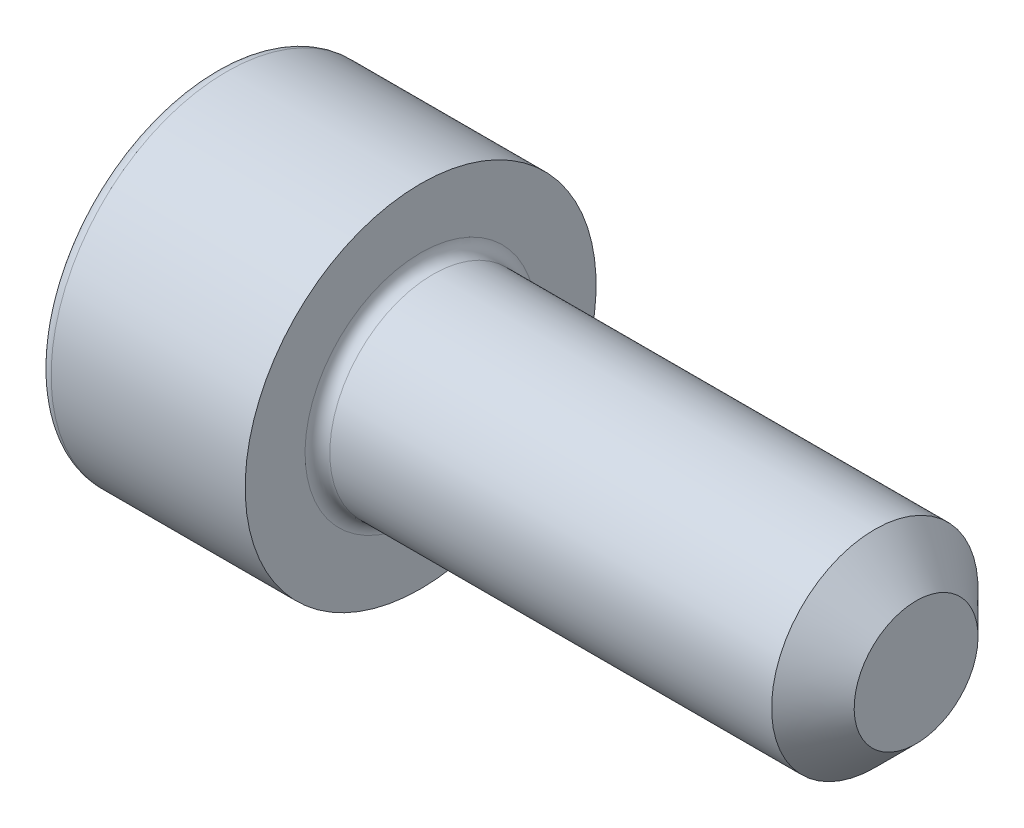
ISO-10303-21;
HEADER;
FILE_DESCRIPTION(('STEP AP214'),'2;1');
FILE_NAME('part.step','',(''),(''),'','','');
FILE_SCHEMA(('AUTOMOTIVE_DESIGN { 1 0 10303 214 1 1 1 1 }'));
ENDSEC;
DATA;
#1=APPLICATION_CONTEXT('core data for automotive mechanical design processes');
#2=APPLICATION_PROTOCOL_DEFINITION('international standard','automotive_design',2000,#1);
#3=PRODUCT_CONTEXT('',#1,'mechanical');
#4=PRODUCT('Part','Part','',(#3));
#5=PRODUCT_RELATED_PRODUCT_CATEGORY('part','',(#4));
#6=PRODUCT_DEFINITION_FORMATION('','',#4);
#7=PRODUCT_DEFINITION_CONTEXT('part definition',#1,'design');
#8=PRODUCT_DEFINITION('design','',#6,#7);
#9=PRODUCT_DEFINITION_SHAPE('','',#8);
#10=(LENGTH_UNIT() NAMED_UNIT(*) SI_UNIT(.MILLI.,.METRE.));
#11=(NAMED_UNIT(*) PLANE_ANGLE_UNIT() SI_UNIT($,.RADIAN.));
#12=(NAMED_UNIT(*) SI_UNIT($,.STERADIAN.) SOLID_ANGLE_UNIT());
#13=UNCERTAINTY_MEASURE_WITH_UNIT(LENGTH_MEASURE(1.E-05),#10,'distance_accuracy_value','');
#14=(GEOMETRIC_REPRESENTATION_CONTEXT(3) GLOBAL_UNCERTAINTY_ASSIGNED_CONTEXT((#13)) GLOBAL_UNIT_ASSIGNED_CONTEXT((#10,
#11,#12)) REPRESENTATION_CONTEXT('',''));
#15=CARTESIAN_POINT('',(0.,0.,0.));
#16=DIRECTION('',(0.,0.,1.));
#17=DIRECTION('',(1.,0.,0.));
#18=AXIS2_PLACEMENT_3D('',#15,#16,#17);
#19=CARTESIAN_POINT('',(0.,0.,0.));
#20=DIRECTION('',(-1.,0.,0.));
#21=DIRECTION('',(0.,-1.,0.));
#22=AXIS2_PLACEMENT_3D('',#19,#20,#21);
#23=PLANE('',#22);
#24=CARTESIAN_POINT('',(0.,0.,0.));
#25=DIRECTION('',(-1.,0.,0.));
#26=DIRECTION('',(0.,-1.,0.));
#27=AXIS2_PLACEMENT_3D('',#24,#25,#26);
#28=CIRCLE('',#27,3.95);
#29=CARTESIAN_POINT('',(0.,-3.95,0.));
#30=VERTEX_POINT('',#29);
#31=EDGE_CURVE('E158',#30,#30,#28,.T.);
#32=ORIENTED_EDGE('',*,*,#31,.T.);
#33=EDGE_LOOP('',(#32));
#34=FACE_BOUND('',#33,.T.);
#35=DIRECTION('',(0.,0.,-1.));
#36=VECTOR('',#35,1.);
#37=CARTESIAN_POINT('',(0.,2.,1.15470053837925));
#38=LINE('',#37,#36);
#39=CARTESIAN_POINT('',(0.,2.,1.15470053837925));
#40=VERTEX_POINT('',#39);
#41=CARTESIAN_POINT('',(0.,2.,-1.15470053837925));
#42=VERTEX_POINT('',#41);
#43=EDGE_CURVE('E54',#40,#42,#38,.T.);
#44=ORIENTED_EDGE('',*,*,#43,.F.);
#45=DIRECTION('',(0.,0.866025403784439,-0.5));
#46=VECTOR('',#45,1.);
#47=CARTESIAN_POINT('',(0.,0.,2.3094010767585));
#48=LINE('',#47,#46);
#49=CARTESIAN_POINT('',(0.,0.,2.3094010767585));
#50=VERTEX_POINT('',#49);
#51=EDGE_CURVE('E137',#50,#40,#48,.T.);
#52=ORIENTED_EDGE('',*,*,#51,.F.);
#53=DIRECTION('',(0.,0.866025403784438,0.5));
#54=VECTOR('',#53,1.);
#55=CARTESIAN_POINT('',(0.,-2.,1.15470053837925));
#56=LINE('',#55,#54);
#57=CARTESIAN_POINT('',(0.,-2.,1.15470053837925));
#58=VERTEX_POINT('',#57);
#59=EDGE_CURVE('E135',#58,#50,#56,.T.);
#60=ORIENTED_EDGE('',*,*,#59,.F.);
#61=DIRECTION('',(0.,0.,1.));
#62=VECTOR('',#61,1.);
#63=CARTESIAN_POINT('',(0.,-2.,-1.15470053837925));
#64=LINE('',#63,#62);
#65=CARTESIAN_POINT('',(0.,-2.,-1.15470053837925));
#66=VERTEX_POINT('',#65);
#67=EDGE_CURVE('E102',#66,#58,#64,.T.);
#68=ORIENTED_EDGE('',*,*,#67,.F.);
#69=DIRECTION('',(0.,-0.866025403784439,0.5));
#70=VECTOR('',#69,1.);
#71=CARTESIAN_POINT('',(0.,0.,-2.3094010767585));
#72=LINE('',#71,#70);
#73=CARTESIAN_POINT('',(0.,0.,-2.3094010767585));
#74=VERTEX_POINT('',#73);
#75=EDGE_CURVE('E131',#74,#66,#72,.T.);
#76=ORIENTED_EDGE('',*,*,#75,.F.);
#77=DIRECTION('',(0.,-0.866025403784439,-0.5));
#78=VECTOR('',#77,1.);
#79=CARTESIAN_POINT('',(0.,2.,-1.15470053837925));
#80=LINE('',#79,#78);
#81=EDGE_CURVE('E128',#42,#74,#80,.T.);
#82=ORIENTED_EDGE('',*,*,#81,.F.);
#83=EDGE_LOOP('',(#44,#52,#60,#68,#76,#82));
#84=FACE_BOUND('',#83,.T.);
#85=ADVANCED_FACE('F38',(#34,#84),#23,.T.);
#86=CARTESIAN_POINT('',(17.,0.,0.));
#87=DIRECTION('',(1.,0.,0.));
#88=DIRECTION('',(0.,1.,0.));
#89=AXIS2_PLACEMENT_3D('',#86,#87,#88);
#90=CYLINDRICAL_SURFACE('',#89,4.25);
#91=CARTESIAN_POINT('',(0.300000000000002,0.,0.));
#92=DIRECTION('',(-1.,0.,0.));
#93=DIRECTION('',(0.,-1.,0.));
#94=AXIS2_PLACEMENT_3D('',#91,#92,#93);
#95=CIRCLE('',#94,4.25);
#96=CARTESIAN_POINT('',(0.300000000000002,-4.25,0.));
#97=VERTEX_POINT('',#96);
#98=EDGE_CURVE('E155',#97,#97,#95,.F.);
#99=ORIENTED_EDGE('',*,*,#98,.T.);
#100=EDGE_LOOP('',(#99));
#101=FACE_BOUND('',#100,.T.);
#102=CARTESIAN_POINT('',(5.,0.,0.));
#103=DIRECTION('',(1.,0.,0.));
#104=DIRECTION('',(0.,1.,0.));
#105=AXIS2_PLACEMENT_3D('',#102,#103,#104);
#106=CIRCLE('',#105,4.25);
#107=CARTESIAN_POINT('',(5.,4.25,0.));
#108=VERTEX_POINT('',#107);
#109=EDGE_CURVE('E141',#108,#108,#106,.T.);
#110=ORIENTED_EDGE('',*,*,#109,.F.);
#111=EDGE_LOOP('',(#110));
#112=FACE_BOUND('',#111,.T.);
#113=ADVANCED_FACE('F175',(#101,#112),#90,.T.);
#114=CARTESIAN_POINT('',(5.,4.25,0.));
#115=DIRECTION('',(1.,0.,0.));
#116=DIRECTION('',(0.,1.,0.));
#117=AXIS2_PLACEMENT_3D('',#114,#115,#116);
#118=PLANE('',#117);
#119=CARTESIAN_POINT('',(5.,0.,0.));
#120=DIRECTION('',(1.,0.,0.));
#121=DIRECTION('',(0.,1.,0.));
#122=AXIS2_PLACEMENT_3D('',#119,#120,#121);
#123=CIRCLE('',#122,2.8);
#124=CARTESIAN_POINT('',(5.,2.8,0.));
#125=VERTEX_POINT('',#124);
#126=EDGE_CURVE('E152',#125,#125,#123,.F.);
#127=ORIENTED_EDGE('',*,*,#126,.T.);
#128=EDGE_LOOP('',(#127));
#129=FACE_BOUND('',#128,.T.);
#130=ORIENTED_EDGE('',*,*,#109,.T.);
#131=EDGE_LOOP('',(#130));
#132=FACE_BOUND('',#131,.T.);
#133=ADVANCED_FACE('F181',(#129,#132),#118,.T.);
#134=CARTESIAN_POINT('',(17.,0.,0.));
#135=DIRECTION('',(1.,0.,0.));
#136=DIRECTION('',(0.,1.,0.));
#137=AXIS2_PLACEMENT_3D('',#134,#135,#136);
#138=CYLINDRICAL_SURFACE('',#137,2.5);
#139=CARTESIAN_POINT('',(16.,0.,0.));
#140=DIRECTION('',(1.,0.,0.));
#141=DIRECTION('',(0.,1.,0.));
#142=AXIS2_PLACEMENT_3D('',#139,#140,#141);
#143=CIRCLE('',#142,2.5);
#144=CARTESIAN_POINT('',(16.,2.5,0.));
#145=VERTEX_POINT('',#144);
#146=EDGE_CURVE('E11',#145,#145,#143,.F.);
#147=ORIENTED_EDGE('',*,*,#146,.T.);
#148=EDGE_LOOP('',(#147));
#149=FACE_BOUND('',#148,.T.);
#150=CARTESIAN_POINT('',(5.3,0.,0.));
#151=DIRECTION('',(1.,0.,0.));
#152=DIRECTION('',(0.,1.,0.));
#153=AXIS2_PLACEMENT_3D('',#150,#151,#152);
#154=CIRCLE('',#153,2.5);
#155=CARTESIAN_POINT('',(5.3,2.5,0.));
#156=VERTEX_POINT('',#155);
#157=EDGE_CURVE('E149',#156,#156,#154,.T.);
#158=ORIENTED_EDGE('',*,*,#157,.T.);
#159=EDGE_LOOP('',(#158));
#160=FACE_BOUND('',#159,.T.);
#161=ADVANCED_FACE('F198',(#149,#160),#138,.T.);
#162=CARTESIAN_POINT('',(17.,2.5,0.));
#163=DIRECTION('',(1.,0.,0.));
#164=DIRECTION('',(0.,1.,0.));
#165=AXIS2_PLACEMENT_3D('',#162,#163,#164);
#166=PLANE('',#165);
#167=CARTESIAN_POINT('',(17.,0.,0.));
#168=DIRECTION('',(1.,0.,0.));
#169=DIRECTION('',(0.,1.,0.));
#170=AXIS2_PLACEMENT_3D('',#167,#168,#169);
#171=CIRCLE('',#170,1.5);
#172=CARTESIAN_POINT('',(17.,1.5,0.));
#173=VERTEX_POINT('',#172);
#174=EDGE_CURVE('E47',#173,#173,#171,.T.);
#175=ORIENTED_EDGE('',*,*,#174,.T.);
#176=EDGE_LOOP('',(#175));
#177=FACE_BOUND('',#176,.T.);
#178=ADVANCED_FACE('F163',(#177),#166,.T.);
#179=CARTESIAN_POINT('',(2.5,2.,1.15470053837925));
#180=DIRECTION('',(0.,1.,0.));
#181=DIRECTION('',(-1.,0.,0.));
#182=AXIS2_PLACEMENT_3D('',#179,#180,#181);
#183=PLANE('',#182);
#184=ORIENTED_EDGE('',*,*,#43,.T.);
#185=DIRECTION('',(-1.,0.,0.));
#186=VECTOR('',#185,1.);
#187=CARTESIAN_POINT('',(2.5,2.,-1.15470053837925));
#188=LINE('',#187,#186);
#189=CARTESIAN_POINT('',(2.5,2.,-1.15470053837925));
#190=VERTEX_POINT('',#189);
#191=EDGE_CURVE('E84',#190,#42,#188,.T.);
#192=ORIENTED_EDGE('',*,*,#191,.F.);
#193=DIRECTION('',(0.,0.,-1.));
#194=VECTOR('',#193,1.);
#195=CARTESIAN_POINT('',(2.5,2.,1.15470053837925));
#196=LINE('',#195,#194);
#197=CARTESIAN_POINT('',(2.5,2.,1.15470053837925));
#198=VERTEX_POINT('',#197);
#199=EDGE_CURVE('E139',#198,#190,#196,.T.);
#200=ORIENTED_EDGE('',*,*,#199,.F.);
#201=DIRECTION('',(-1.,0.,0.));
#202=VECTOR('',#201,1.);
#203=CARTESIAN_POINT('',(2.5,2.,1.15470053837925));
#204=LINE('',#203,#202);
#205=EDGE_CURVE('E62',#198,#40,#204,.T.);
#206=ORIENTED_EDGE('',*,*,#205,.T.);
#207=EDGE_LOOP('',(#184,#192,#200,#206));
#208=FACE_BOUND('',#207,.T.);
#209=ADVANCED_FACE('F206',(#208),#183,.F.);
#210=CARTESIAN_POINT('',(2.5,0.,2.3094010767585));
#211=DIRECTION('',(0.,0.5,0.866025403784439));
#212=DIRECTION('',(0.,-0.866025403784439,0.5));
#213=AXIS2_PLACEMENT_3D('',#210,#211,#212);
#214=PLANE('',#213);
#215=ORIENTED_EDGE('',*,*,#51,.T.);
#216=ORIENTED_EDGE('',*,*,#205,.F.);
#217=DIRECTION('',(0.,0.866025403784439,-0.5));
#218=VECTOR('',#217,1.);
#219=CARTESIAN_POINT('',(2.5,0.,2.3094010767585));
#220=LINE('',#219,#218);
#221=CARTESIAN_POINT('',(2.5,0.,2.3094010767585));
#222=VERTEX_POINT('',#221);
#223=EDGE_CURVE('E114',#222,#198,#220,.T.);
#224=ORIENTED_EDGE('',*,*,#223,.F.);
#225=DIRECTION('',(-1.,0.,0.));
#226=VECTOR('',#225,1.);
#227=CARTESIAN_POINT('',(2.5,0.,2.3094010767585));
#228=LINE('',#227,#226);
#229=EDGE_CURVE('E106',#222,#50,#228,.T.);
#230=ORIENTED_EDGE('',*,*,#229,.T.);
#231=EDGE_LOOP('',(#215,#216,#224,#230));
#232=FACE_BOUND('',#231,.T.);
#233=ADVANCED_FACE('F212',(#232),#214,.F.);
#234=CARTESIAN_POINT('',(2.5,-2.,1.15470053837925));
#235=DIRECTION('',(0.,-0.5,0.866025403784438));
#236=DIRECTION('',(0.,-0.866025403784439,-0.5));
#237=AXIS2_PLACEMENT_3D('',#234,#235,#236);
#238=PLANE('',#237);
#239=ORIENTED_EDGE('',*,*,#59,.T.);
#240=ORIENTED_EDGE('',*,*,#229,.F.);
#241=DIRECTION('',(0.,0.866025403784438,0.5));
#242=VECTOR('',#241,1.);
#243=CARTESIAN_POINT('',(2.5,-2.,1.15470053837925));
#244=LINE('',#243,#242);
#245=CARTESIAN_POINT('',(2.5,-2.,1.15470053837925));
#246=VERTEX_POINT('',#245);
#247=EDGE_CURVE('E110',#246,#222,#244,.T.);
#248=ORIENTED_EDGE('',*,*,#247,.F.);
#249=DIRECTION('',(-1.,0.,0.));
#250=VECTOR('',#249,1.);
#251=CARTESIAN_POINT('',(2.5,-2.,1.15470053837925));
#252=LINE('',#251,#250);
#253=EDGE_CURVE('E95',#246,#58,#252,.T.);
#254=ORIENTED_EDGE('',*,*,#253,.T.);
#255=EDGE_LOOP('',(#239,#240,#248,#254));
#256=FACE_BOUND('',#255,.T.);
#257=ADVANCED_FACE('F111',(#256),#238,.F.);
#258=CARTESIAN_POINT('',(2.5,-2.,-1.15470053837925));
#259=DIRECTION('',(0.,-1.,0.));
#260=DIRECTION('',(0.,0.,-1.));
#261=AXIS2_PLACEMENT_3D('',#258,#259,#260);
#262=PLANE('',#261);
#263=ORIENTED_EDGE('',*,*,#67,.T.);
#264=ORIENTED_EDGE('',*,*,#253,.F.);
#265=DIRECTION('',(0.,0.,1.));
#266=VECTOR('',#265,1.);
#267=CARTESIAN_POINT('',(2.5,-2.,-1.15470053837925));
#268=LINE('',#267,#266);
#269=CARTESIAN_POINT('',(2.5,-2.,-1.15470053837925));
#270=VERTEX_POINT('',#269);
#271=EDGE_CURVE('E99',#270,#246,#268,.T.);
#272=ORIENTED_EDGE('',*,*,#271,.F.);
#273=DIRECTION('',(-1.,0.,0.));
#274=VECTOR('',#273,1.);
#275=CARTESIAN_POINT('',(2.5,-2.,-1.15470053837925));
#276=LINE('',#275,#274);
#277=EDGE_CURVE('E107',#270,#66,#276,.T.);
#278=ORIENTED_EDGE('',*,*,#277,.T.);
#279=EDGE_LOOP('',(#263,#264,#272,#278));
#280=FACE_BOUND('',#279,.T.);
#281=ADVANCED_FACE('F97',(#280),#262,.F.);
#282=CARTESIAN_POINT('',(2.5,0.,-2.3094010767585));
#283=DIRECTION('',(0.,-0.5,-0.866025403784439));
#284=DIRECTION('',(0.,0.866025403784439,-0.5));
#285=AXIS2_PLACEMENT_3D('',#282,#283,#284);
#286=PLANE('',#285);
#287=ORIENTED_EDGE('',*,*,#75,.T.);
#288=ORIENTED_EDGE('',*,*,#277,.F.);
#289=DIRECTION('',(0.,-0.866025403784439,0.5));
#290=VECTOR('',#289,1.);
#291=CARTESIAN_POINT('',(2.5,0.,-2.3094010767585));
#292=LINE('',#291,#290);
#293=CARTESIAN_POINT('',(2.5,0.,-2.3094010767585));
#294=VERTEX_POINT('',#293);
#295=EDGE_CURVE('E120',#294,#270,#292,.T.);
#296=ORIENTED_EDGE('',*,*,#295,.F.);
#297=DIRECTION('',(-1.,0.,0.));
#298=VECTOR('',#297,1.);
#299=CARTESIAN_POINT('',(2.5,0.,-2.3094010767585));
#300=LINE('',#299,#298);
#301=EDGE_CURVE('E144',#294,#74,#300,.T.);
#302=ORIENTED_EDGE('',*,*,#301,.T.);
#303=EDGE_LOOP('',(#287,#288,#296,#302));
#304=FACE_BOUND('',#303,.T.);
#305=ADVANCED_FACE('F215',(#304),#286,.F.);
#306=CARTESIAN_POINT('',(2.5,2.,-1.15470053837925));
#307=DIRECTION('',(0.,0.5,-0.866025403784439));
#308=DIRECTION('',(0.,0.866025403784439,0.5));
#309=AXIS2_PLACEMENT_3D('',#306,#307,#308);
#310=PLANE('',#309);
#311=ORIENTED_EDGE('',*,*,#81,.T.);
#312=ORIENTED_EDGE('',*,*,#301,.F.);
#313=DIRECTION('',(0.,-0.866025403784439,-0.5));
#314=VECTOR('',#313,1.);
#315=CARTESIAN_POINT('',(2.5,2.,-1.15470053837925));
#316=LINE('',#315,#314);
#317=EDGE_CURVE('E122',#190,#294,#316,.T.);
#318=ORIENTED_EDGE('',*,*,#317,.F.);
#319=ORIENTED_EDGE('',*,*,#191,.T.);
#320=EDGE_LOOP('',(#311,#312,#318,#319));
#321=FACE_BOUND('',#320,.T.);
#322=ADVANCED_FACE('F192',(#321),#310,.F.);
#323=CARTESIAN_POINT('',(2.5,0.,0.));
#324=DIRECTION('',(-1.,0.,0.));
#325=DIRECTION('',(0.,-1.,0.));
#326=AXIS2_PLACEMENT_3D('',#323,#324,#325);
#327=PLANE('',#326);
#328=ORIENTED_EDGE('',*,*,#199,.T.);
#329=ORIENTED_EDGE('',*,*,#317,.T.);
#330=ORIENTED_EDGE('',*,*,#295,.T.);
#331=ORIENTED_EDGE('',*,*,#271,.T.);
#332=ORIENTED_EDGE('',*,*,#247,.T.);
#333=ORIENTED_EDGE('',*,*,#223,.T.);
#334=EDGE_LOOP('',(#328,#329,#330,#331,#332,#333));
#335=FACE_BOUND('',#334,.T.);
#336=ADVANCED_FACE('F117',(#335),#327,.T.);
#337=CARTESIAN_POINT('',(5.3,0.,0.));
#338=DIRECTION('',(1.,0.,0.));
#339=DIRECTION('',(0.,1.,0.));
#340=AXIS2_PLACEMENT_3D('',#337,#338,#339);
#341=TOROIDAL_SURFACE('',#340,2.8,0.3);
#342=ORIENTED_EDGE('',*,*,#126,.F.);
#343=EDGE_LOOP('',(#342));
#344=FACE_BOUND('',#343,.T.);
#345=ORIENTED_EDGE('',*,*,#157,.F.);
#346=EDGE_LOOP('',(#345));
#347=FACE_BOUND('',#346,.T.);
#348=ADVANCED_FACE('F171',(#344,#347),#341,.F.);
#349=CARTESIAN_POINT('',(0.300000000000002,0.,0.));
#350=DIRECTION('',(-1.,0.,0.));
#351=DIRECTION('',(0.,-1.,0.));
#352=AXIS2_PLACEMENT_3D('',#349,#350,#351);
#353=TOROIDAL_SURFACE('',#352,3.95,0.3);
#354=ORIENTED_EDGE('',*,*,#31,.F.);
#355=EDGE_LOOP('',(#354));
#356=FACE_BOUND('',#355,.T.);
#357=ORIENTED_EDGE('',*,*,#98,.F.);
#358=EDGE_LOOP('',(#357));
#359=FACE_BOUND('',#358,.T.);
#360=ADVANCED_FACE('F166',(#356,#359),#353,.T.);
#361=CARTESIAN_POINT('',(17.,0.,0.));
#362=DIRECTION('',(-1.,0.,0.));
#363=DIRECTION('',(0.,-1.,0.));
#364=AXIS2_PLACEMENT_3D('',#361,#362,#363);
#365=CONICAL_SURFACE('',#364,1.5,0.785398163397446);
#366=ORIENTED_EDGE('',*,*,#146,.F.);
#367=EDGE_LOOP('',(#366));
#368=FACE_BOUND('',#367,.T.);
#369=ORIENTED_EDGE('',*,*,#174,.F.);
#370=EDGE_LOOP('',(#369));
#371=FACE_BOUND('',#370,.T.);
#372=ADVANCED_FACE('F41',(#368,#371),#365,.T.);
#373=CLOSED_SHELL('',(#85,#113,#133,#161,#178,#209,#233,#257,#281,#305,#322,#336,#348,#360,#372));
#374=MANIFOLD_SOLID_BREP('B2',#373);
#375=ADVANCED_BREP_SHAPE_REPRESENTATION('',(#18,#374),#14);
#376=SHAPE_DEFINITION_REPRESENTATION(#9,#375);
ENDSEC;
END-ISO-10303-21;
